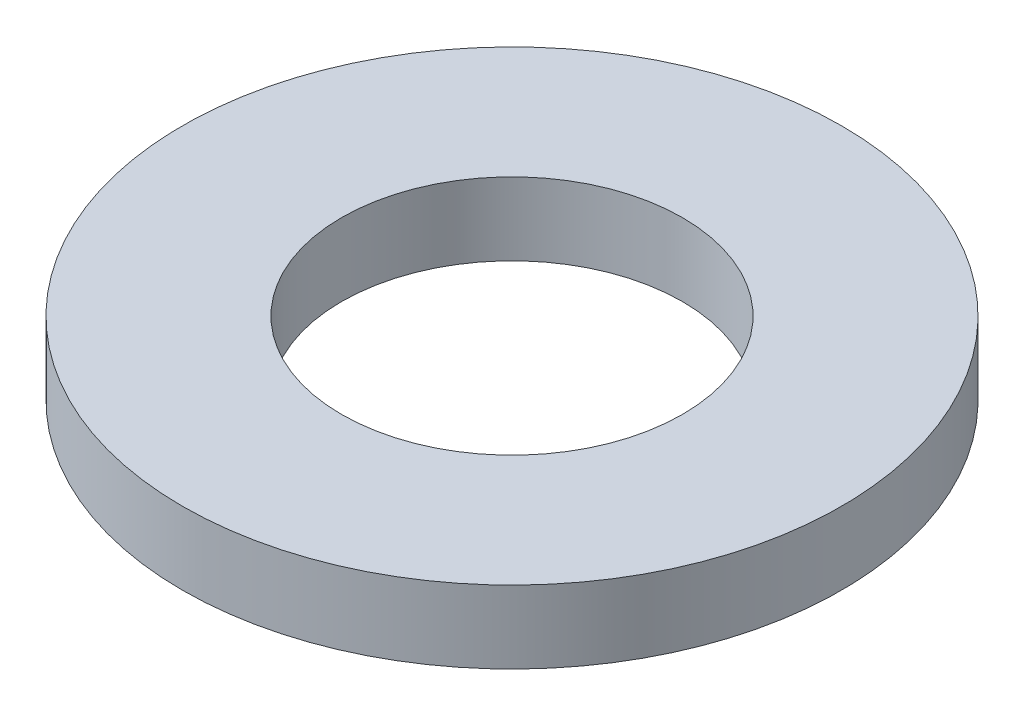
ISO-10303-21;
HEADER;
FILE_DESCRIPTION(('STEP AP214'),'2;1');
FILE_NAME('part.step','',(''),(''),'','','');
FILE_SCHEMA(('AUTOMOTIVE_DESIGN { 1 0 10303 214 1 1 1 1 }'));
ENDSEC;
DATA;
#1=APPLICATION_CONTEXT('core data for automotive mechanical design processes');
#2=APPLICATION_PROTOCOL_DEFINITION('international standard','automotive_design',2000,#1);
#3=PRODUCT_CONTEXT('',#1,'mechanical');
#4=PRODUCT('Part','Part','',(#3));
#5=PRODUCT_RELATED_PRODUCT_CATEGORY('part','',(#4));
#6=PRODUCT_DEFINITION_FORMATION('','',#4);
#7=PRODUCT_DEFINITION_CONTEXT('part definition',#1,'design');
#8=PRODUCT_DEFINITION('design','',#6,#7);
#9=PRODUCT_DEFINITION_SHAPE('','',#8);
#10=(LENGTH_UNIT() NAMED_UNIT(*) SI_UNIT(.MILLI.,.METRE.));
#11=(NAMED_UNIT(*) PLANE_ANGLE_UNIT() SI_UNIT($,.RADIAN.));
#12=(NAMED_UNIT(*) SI_UNIT($,.STERADIAN.) SOLID_ANGLE_UNIT());
#13=UNCERTAINTY_MEASURE_WITH_UNIT(LENGTH_MEASURE(1.E-05),#10,'distance_accuracy_value','');
#14=(GEOMETRIC_REPRESENTATION_CONTEXT(3) GLOBAL_UNCERTAINTY_ASSIGNED_CONTEXT((#13)) GLOBAL_UNIT_ASSIGNED_CONTEXT((#10,
#11,#12)) REPRESENTATION_CONTEXT('',''));
#15=CARTESIAN_POINT('',(0.,0.,0.));
#16=DIRECTION('',(0.,0.,1.));
#17=DIRECTION('',(1.,0.,0.));
#18=AXIS2_PLACEMENT_3D('',#15,#16,#17);
#19=CARTESIAN_POINT('',(0.,16.,0.));
#20=DIRECTION('',(0.,-1.,0.));
#21=DIRECTION('',(0.,0.,-1.));
#22=AXIS2_PLACEMENT_3D('',#19,#20,#21);
#23=CYLINDRICAL_SURFACE('',#22,72.5);
#24=CARTESIAN_POINT('',(0.,16.,0.));
#25=DIRECTION('',(0.,1.,0.));
#26=DIRECTION('',(0.,0.,1.));
#27=AXIS2_PLACEMENT_3D('',#24,#25,#26);
#28=CIRCLE('',#27,72.5);
#29=CARTESIAN_POINT('',(0.,16.,72.5));
#30=VERTEX_POINT('',#29);
#31=EDGE_CURVE('E10',#30,#30,#28,.T.);
#32=ORIENTED_EDGE('',*,*,#31,.F.);
#33=EDGE_LOOP('',(#32));
#34=FACE_BOUND('',#33,.T.);
#35=CARTESIAN_POINT('',(0.,0.,0.));
#36=DIRECTION('',(0.,1.,0.));
#37=DIRECTION('',(0.,0.,1.));
#38=AXIS2_PLACEMENT_3D('',#35,#36,#37);
#39=CIRCLE('',#38,72.5);
#40=CARTESIAN_POINT('',(0.,0.,72.5));
#41=VERTEX_POINT('',#40);
#42=EDGE_CURVE('E37',#41,#41,#39,.T.);
#43=ORIENTED_EDGE('',*,*,#42,.T.);
#44=EDGE_LOOP('',(#43));
#45=FACE_BOUND('',#44,.T.);
#46=ADVANCED_FACE('F40',(#34,#45),#23,.T.);
#47=CARTESIAN_POINT('',(0.,16.,0.));
#48=DIRECTION('',(0.,1.,0.));
#49=DIRECTION('',(0.,0.,1.));
#50=AXIS2_PLACEMENT_3D('',#47,#48,#49);
#51=PLANE('',#50);
#52=CARTESIAN_POINT('',(0.,16.,0.));
#53=DIRECTION('',(0.,1.,0.));
#54=DIRECTION('',(0.,0.,1.));
#55=AXIS2_PLACEMENT_3D('',#52,#53,#54);
#56=CIRCLE('',#55,37.5);
#57=CARTESIAN_POINT('',(0.,16.,37.5));
#58=VERTEX_POINT('',#57);
#59=EDGE_CURVE('E50',#58,#58,#56,.T.);
#60=ORIENTED_EDGE('',*,*,#59,.F.);
#61=EDGE_LOOP('',(#60));
#62=FACE_BOUND('',#61,.T.);
#63=ORIENTED_EDGE('',*,*,#31,.T.);
#64=EDGE_LOOP('',(#63));
#65=FACE_BOUND('',#64,.T.);
#66=ADVANCED_FACE('F59',(#62,#65),#51,.T.);
#67=CARTESIAN_POINT('',(0.,0.,0.));
#68=DIRECTION('',(0.,1.,0.));
#69=DIRECTION('',(0.,0.,1.));
#70=AXIS2_PLACEMENT_3D('',#67,#68,#69);
#71=PLANE('',#70);
#72=CARTESIAN_POINT('',(0.,0.,0.));
#73=DIRECTION('',(0.,1.,0.));
#74=DIRECTION('',(0.,0.,1.));
#75=AXIS2_PLACEMENT_3D('',#72,#73,#74);
#76=CIRCLE('',#75,37.5);
#77=CARTESIAN_POINT('',(0.,0.,37.5));
#78=VERTEX_POINT('',#77);
#79=EDGE_CURVE('E47',#78,#78,#76,.T.);
#80=ORIENTED_EDGE('',*,*,#79,.T.);
#81=EDGE_LOOP('',(#80));
#82=FACE_BOUND('',#81,.T.);
#83=ORIENTED_EDGE('',*,*,#42,.F.);
#84=EDGE_LOOP('',(#83));
#85=FACE_BOUND('',#84,.T.);
#86=ADVANCED_FACE('F58',(#82,#85),#71,.F.);
#87=CARTESIAN_POINT('',(0.,16.,0.));
#88=DIRECTION('',(0.,-1.,0.));
#89=DIRECTION('',(0.,0.,-1.));
#90=AXIS2_PLACEMENT_3D('',#87,#88,#89);
#91=CYLINDRICAL_SURFACE('',#90,37.5);
#92=ORIENTED_EDGE('',*,*,#59,.T.);
#93=EDGE_LOOP('',(#92));
#94=FACE_BOUND('',#93,.T.);
#95=ORIENTED_EDGE('',*,*,#79,.F.);
#96=EDGE_LOOP('',(#95));
#97=FACE_BOUND('',#96,.T.);
#98=ADVANCED_FACE('F54',(#94,#97),#91,.F.);
#99=CLOSED_SHELL('',(#46,#66,#86,#98));
#100=MANIFOLD_SOLID_BREP('B2',#99);
#101=ADVANCED_BREP_SHAPE_REPRESENTATION('',(#18,#100),#14);
#102=SHAPE_DEFINITION_REPRESENTATION(#9,#101);
ENDSEC;
END-ISO-10303-21;
